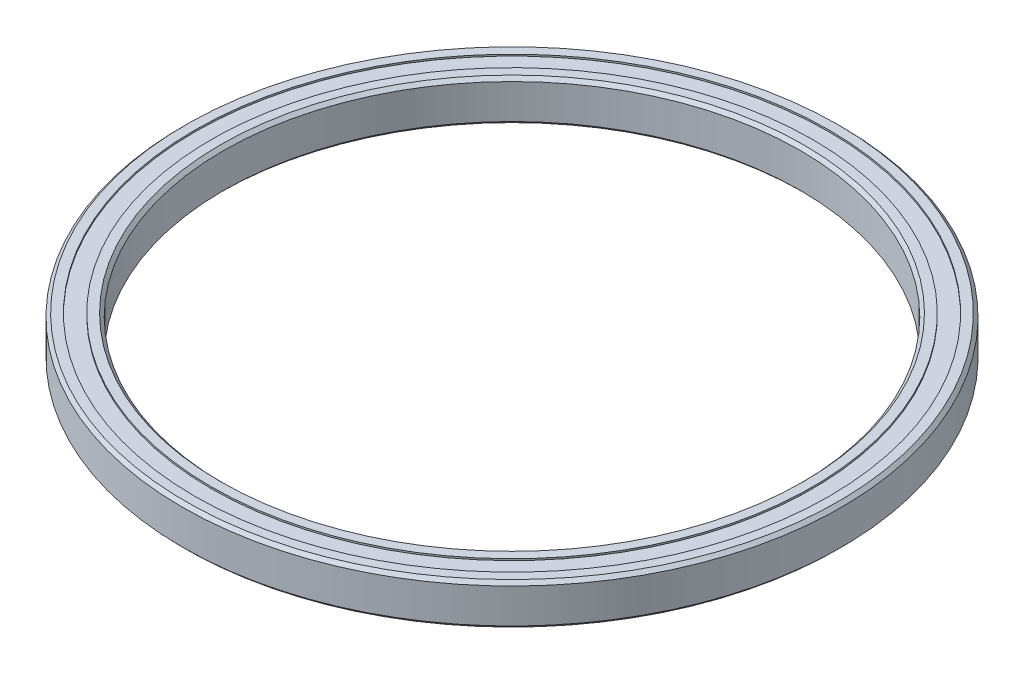
ISO-10303-21;
HEADER;
FILE_DESCRIPTION(('STEP AP214'),'2;1');
FILE_NAME('part.step','',(''),(''),'','','');
FILE_SCHEMA(('AUTOMOTIVE_DESIGN { 1 0 10303 214 1 1 1 1 }'));
ENDSEC;
DATA;
#1=APPLICATION_CONTEXT('core data for automotive mechanical design processes');
#2=APPLICATION_PROTOCOL_DEFINITION('international standard','automotive_design',2000,#1);
#3=PRODUCT_CONTEXT('',#1,'mechanical');
#4=PRODUCT('Part','Part','',(#3));
#5=PRODUCT_RELATED_PRODUCT_CATEGORY('part','',(#4));
#6=PRODUCT_DEFINITION_FORMATION('','',#4);
#7=PRODUCT_DEFINITION_CONTEXT('part definition',#1,'design');
#8=PRODUCT_DEFINITION('design','',#6,#7);
#9=PRODUCT_DEFINITION_SHAPE('','',#8);
#10=(LENGTH_UNIT() NAMED_UNIT(*) SI_UNIT(.MILLI.,.METRE.));
#11=(NAMED_UNIT(*) PLANE_ANGLE_UNIT() SI_UNIT($,.RADIAN.));
#12=(NAMED_UNIT(*) SI_UNIT($,.STERADIAN.) SOLID_ANGLE_UNIT());
#13=UNCERTAINTY_MEASURE_WITH_UNIT(LENGTH_MEASURE(1.E-05),#10,'distance_accuracy_value','');
#14=(GEOMETRIC_REPRESENTATION_CONTEXT(3) GLOBAL_UNCERTAINTY_ASSIGNED_CONTEXT((#13)) GLOBAL_UNIT_ASSIGNED_CONTEXT((#10,
#11,#12)) REPRESENTATION_CONTEXT('',''));
#15=CARTESIAN_POINT('',(0.,0.,0.));
#16=DIRECTION('',(0.,0.,1.));
#17=DIRECTION('',(1.,0.,0.));
#18=AXIS2_PLACEMENT_3D('',#15,#16,#17);
#19=CARTESIAN_POINT('',(0.,3.175,0.));
#20=DIRECTION('',(0.,-1.,0.));
#21=DIRECTION('',(0.,0.,-1.));
#22=AXIS2_PLACEMENT_3D('',#19,#20,#21);
#23=CONICAL_SURFACE('',#22,50.292,0.785398163397459);
#24=CARTESIAN_POINT('',(0.,2.667,0.));
#25=DIRECTION('',(0.,-1.,0.));
#26=DIRECTION('',(0.,0.,-1.));
#27=AXIS2_PLACEMENT_3D('',#24,#25,#26);
#28=CIRCLE('',#27,50.8);
#29=CARTESIAN_POINT('',(0.,2.667,-50.8));
#30=VERTEX_POINT('',#29);
#31=EDGE_CURVE('E66',#30,#30,#28,.T.);
#32=ORIENTED_EDGE('',*,*,#31,.F.);
#33=EDGE_LOOP('',(#32));
#34=FACE_BOUND('',#33,.T.);
#35=CARTESIAN_POINT('',(0.,3.175,0.));
#36=DIRECTION('',(0.,-1.,0.));
#37=DIRECTION('',(0.,0.,-1.));
#38=AXIS2_PLACEMENT_3D('',#35,#36,#37);
#39=CIRCLE('',#38,50.292);
#40=CARTESIAN_POINT('',(0.,3.175,-50.292));
#41=VERTEX_POINT('',#40);
#42=EDGE_CURVE('E10',#41,#41,#39,.T.);
#43=ORIENTED_EDGE('',*,*,#42,.T.);
#44=EDGE_LOOP('',(#43));
#45=FACE_BOUND('',#44,.T.);
#46=ADVANCED_FACE('F14',(#34,#45),#23,.T.);
#47=CARTESIAN_POINT('',(-50.292,3.175,0.));
#48=DIRECTION('',(0.,-1.,0.));
#49=DIRECTION('',(0.,0.,-1.));
#50=AXIS2_PLACEMENT_3D('',#47,#48,#49);
#51=PLANE('',#50);
#52=ORIENTED_EDGE('',*,*,#42,.F.);
#53=EDGE_LOOP('',(#52));
#54=FACE_BOUND('',#53,.T.);
#55=CARTESIAN_POINT('',(0.,3.175,0.));
#56=DIRECTION('',(0.,-1.,0.));
#57=DIRECTION('',(0.,0.,-1.));
#58=AXIS2_PLACEMENT_3D('',#55,#56,#57);
#59=CIRCLE('',#58,48.895);
#60=CARTESIAN_POINT('',(0.,3.175,-48.895));
#61=VERTEX_POINT('',#60);
#62=EDGE_CURVE('E20',#61,#61,#59,.T.);
#63=ORIENTED_EDGE('',*,*,#62,.T.);
#64=EDGE_LOOP('',(#63));
#65=FACE_BOUND('',#64,.T.);
#66=ADVANCED_FACE('F73',(#54,#65),#51,.F.);
#67=CARTESIAN_POINT('',(0.,0.,0.));
#68=DIRECTION('',(0.,-1.,0.));
#69=DIRECTION('',(0.,0.,-1.));
#70=AXIS2_PLACEMENT_3D('',#67,#68,#69);
#71=CYLINDRICAL_SURFACE('',#70,48.895);
#72=ORIENTED_EDGE('',*,*,#62,.F.);
#73=EDGE_LOOP('',(#72));
#74=FACE_BOUND('',#73,.T.);
#75=CARTESIAN_POINT('',(0.,2.921,0.));
#76=DIRECTION('',(0.,-1.,0.));
#77=DIRECTION('',(0.,0.,-1.));
#78=AXIS2_PLACEMENT_3D('',#75,#76,#77);
#79=CIRCLE('',#78,48.895);
#80=CARTESIAN_POINT('',(0.,2.921,-48.895));
#81=VERTEX_POINT('',#80);
#82=EDGE_CURVE('E24',#81,#81,#79,.T.);
#83=ORIENTED_EDGE('',*,*,#82,.T.);
#84=EDGE_LOOP('',(#83));
#85=FACE_BOUND('',#84,.T.);
#86=ADVANCED_FACE('F79',(#74,#85),#71,.F.);
#87=CARTESIAN_POINT('',(-48.895,2.921,0.));
#88=DIRECTION('',(0.,-1.,0.));
#89=DIRECTION('',(0.,0.,-1.));
#90=AXIS2_PLACEMENT_3D('',#87,#88,#89);
#91=PLANE('',#90);
#92=ORIENTED_EDGE('',*,*,#82,.F.);
#93=EDGE_LOOP('',(#92));
#94=FACE_BOUND('',#93,.T.);
#95=CARTESIAN_POINT('',(0.,2.921,0.));
#96=DIRECTION('',(0.,-1.,0.));
#97=DIRECTION('',(0.,0.,-1.));
#98=AXIS2_PLACEMENT_3D('',#95,#96,#97);
#99=CIRCLE('',#98,46.355);
#100=CARTESIAN_POINT('',(0.,2.921,-46.355));
#101=VERTEX_POINT('',#100);
#102=EDGE_CURVE('E28',#101,#101,#99,.T.);
#103=ORIENTED_EDGE('',*,*,#102,.T.);
#104=EDGE_LOOP('',(#103));
#105=FACE_BOUND('',#104,.T.);
#106=ADVANCED_FACE('F85',(#94,#105),#91,.F.);
#107=CARTESIAN_POINT('',(0.,0.,0.));
#108=DIRECTION('',(0.,-1.,0.));
#109=DIRECTION('',(0.,0.,-1.));
#110=AXIS2_PLACEMENT_3D('',#107,#108,#109);
#111=CYLINDRICAL_SURFACE('',#110,46.355);
#112=ORIENTED_EDGE('',*,*,#102,.F.);
#113=EDGE_LOOP('',(#112));
#114=FACE_BOUND('',#113,.T.);
#115=CARTESIAN_POINT('',(0.,3.175,0.));
#116=DIRECTION('',(0.,-1.,0.));
#117=DIRECTION('',(0.,0.,-1.));
#118=AXIS2_PLACEMENT_3D('',#115,#116,#117);
#119=CIRCLE('',#118,46.355);
#120=CARTESIAN_POINT('',(0.,3.175,-46.355));
#121=VERTEX_POINT('',#120);
#122=EDGE_CURVE('E33',#121,#121,#119,.T.);
#123=ORIENTED_EDGE('',*,*,#122,.T.);
#124=EDGE_LOOP('',(#123));
#125=FACE_BOUND('',#124,.T.);
#126=ADVANCED_FACE('F91',(#114,#125),#111,.T.);
#127=CARTESIAN_POINT('',(-46.355,3.175,0.));
#128=DIRECTION('',(0.,-1.,0.));
#129=DIRECTION('',(0.,0.,-1.));
#130=AXIS2_PLACEMENT_3D('',#127,#128,#129);
#131=PLANE('',#130);
#132=ORIENTED_EDGE('',*,*,#122,.F.);
#133=EDGE_LOOP('',(#132));
#134=FACE_BOUND('',#133,.T.);
#135=CARTESIAN_POINT('',(0.,3.175,0.));
#136=DIRECTION('',(0.,-1.,0.));
#137=DIRECTION('',(0.,0.,-1.));
#138=AXIS2_PLACEMENT_3D('',#135,#136,#137);
#139=CIRCLE('',#138,44.958);
#140=CARTESIAN_POINT('',(0.,3.175,-44.958));
#141=VERTEX_POINT('',#140);
#142=EDGE_CURVE('E36',#141,#141,#139,.T.);
#143=ORIENTED_EDGE('',*,*,#142,.T.);
#144=EDGE_LOOP('',(#143));
#145=FACE_BOUND('',#144,.T.);
#146=ADVANCED_FACE('F95',(#134,#145),#131,.F.);
#147=CARTESIAN_POINT('',(0.,2.667,0.));
#148=DIRECTION('',(0.,1.,0.));
#149=DIRECTION('',(0.,0.,1.));
#150=AXIS2_PLACEMENT_3D('',#147,#148,#149);
#151=CONICAL_SURFACE('',#150,44.45,0.785398163397448);
#152=ORIENTED_EDGE('',*,*,#142,.F.);
#153=EDGE_LOOP('',(#152));
#154=FACE_BOUND('',#153,.T.);
#155=CARTESIAN_POINT('',(0.,2.667,0.));
#156=DIRECTION('',(0.,-1.,0.));
#157=DIRECTION('',(0.,0.,-1.));
#158=AXIS2_PLACEMENT_3D('',#155,#156,#157);
#159=CIRCLE('',#158,44.45);
#160=CARTESIAN_POINT('',(0.,2.667,-44.45));
#161=VERTEX_POINT('',#160);
#162=EDGE_CURVE('E39',#161,#161,#159,.T.);
#163=ORIENTED_EDGE('',*,*,#162,.T.);
#164=EDGE_LOOP('',(#163));
#165=FACE_BOUND('',#164,.T.);
#166=ADVANCED_FACE('F99',(#154,#165),#151,.F.);
#167=CARTESIAN_POINT('',(0.,0.,0.));
#168=DIRECTION('',(0.,-1.,0.));
#169=DIRECTION('',(0.,0.,-1.));
#170=AXIS2_PLACEMENT_3D('',#167,#168,#169);
#171=CYLINDRICAL_SURFACE('',#170,44.45);
#172=ORIENTED_EDGE('',*,*,#162,.F.);
#173=EDGE_LOOP('',(#172));
#174=FACE_BOUND('',#173,.T.);
#175=CARTESIAN_POINT('',(0.,-2.667,0.));
#176=DIRECTION('',(0.,-1.,0.));
#177=DIRECTION('',(0.,0.,-1.));
#178=AXIS2_PLACEMENT_3D('',#175,#176,#177);
#179=CIRCLE('',#178,44.45);
#180=CARTESIAN_POINT('',(0.,-2.667,-44.45));
#181=VERTEX_POINT('',#180);
#182=EDGE_CURVE('E42',#181,#181,#179,.T.);
#183=ORIENTED_EDGE('',*,*,#182,.T.);
#184=EDGE_LOOP('',(#183));
#185=FACE_BOUND('',#184,.T.);
#186=ADVANCED_FACE('F103',(#174,#185),#171,.F.);
#187=CARTESIAN_POINT('',(0.,-3.175,0.));
#188=DIRECTION('',(0.,-1.,0.));
#189=DIRECTION('',(0.,0.,-1.));
#190=AXIS2_PLACEMENT_3D('',#187,#188,#189);
#191=CONICAL_SURFACE('',#190,44.958,0.785398163397445);
#192=ORIENTED_EDGE('',*,*,#182,.F.);
#193=EDGE_LOOP('',(#192));
#194=FACE_BOUND('',#193,.T.);
#195=CARTESIAN_POINT('',(0.,-3.175,0.));
#196=DIRECTION('',(0.,-1.,0.));
#197=DIRECTION('',(0.,0.,-1.));
#198=AXIS2_PLACEMENT_3D('',#195,#196,#197);
#199=CIRCLE('',#198,44.958);
#200=CARTESIAN_POINT('',(0.,-3.175,-44.958));
#201=VERTEX_POINT('',#200);
#202=EDGE_CURVE('E45',#201,#201,#199,.T.);
#203=ORIENTED_EDGE('',*,*,#202,.T.);
#204=EDGE_LOOP('',(#203));
#205=FACE_BOUND('',#204,.T.);
#206=ADVANCED_FACE('F107',(#194,#205),#191,.F.);
#207=CARTESIAN_POINT('',(-44.958,-3.175,0.));
#208=DIRECTION('',(0.,1.,0.));
#209=DIRECTION('',(0.,0.,1.));
#210=AXIS2_PLACEMENT_3D('',#207,#208,#209);
#211=PLANE('',#210);
#212=ORIENTED_EDGE('',*,*,#202,.F.);
#213=EDGE_LOOP('',(#212));
#214=FACE_BOUND('',#213,.T.);
#215=CARTESIAN_POINT('',(0.,-3.175,0.));
#216=DIRECTION('',(0.,-1.,0.));
#217=DIRECTION('',(0.,0.,-1.));
#218=AXIS2_PLACEMENT_3D('',#215,#216,#217);
#219=CIRCLE('',#218,46.355);
#220=CARTESIAN_POINT('',(0.,-3.175,-46.355));
#221=VERTEX_POINT('',#220);
#222=EDGE_CURVE('E48',#221,#221,#219,.T.);
#223=ORIENTED_EDGE('',*,*,#222,.T.);
#224=EDGE_LOOP('',(#223));
#225=FACE_BOUND('',#224,.T.);
#226=ADVANCED_FACE('F111',(#214,#225),#211,.F.);
#227=CARTESIAN_POINT('',(0.,0.,0.));
#228=DIRECTION('',(0.,-1.,0.));
#229=DIRECTION('',(0.,0.,-1.));
#230=AXIS2_PLACEMENT_3D('',#227,#228,#229);
#231=CYLINDRICAL_SURFACE('',#230,46.355);
#232=ORIENTED_EDGE('',*,*,#222,.F.);
#233=EDGE_LOOP('',(#232));
#234=FACE_BOUND('',#233,.T.);
#235=CARTESIAN_POINT('',(0.,-2.921,0.));
#236=DIRECTION('',(0.,-1.,0.));
#237=DIRECTION('',(0.,0.,-1.));
#238=AXIS2_PLACEMENT_3D('',#235,#236,#237);
#239=CIRCLE('',#238,46.355);
#240=CARTESIAN_POINT('',(0.,-2.921,-46.355));
#241=VERTEX_POINT('',#240);
#242=EDGE_CURVE('E51',#241,#241,#239,.T.);
#243=ORIENTED_EDGE('',*,*,#242,.T.);
#244=EDGE_LOOP('',(#243));
#245=FACE_BOUND('',#244,.T.);
#246=ADVANCED_FACE('F115',(#234,#245),#231,.T.);
#247=CARTESIAN_POINT('',(-46.355,-2.921,0.));
#248=DIRECTION('',(0.,1.,0.));
#249=DIRECTION('',(0.,0.,1.));
#250=AXIS2_PLACEMENT_3D('',#247,#248,#249);
#251=PLANE('',#250);
#252=ORIENTED_EDGE('',*,*,#242,.F.);
#253=EDGE_LOOP('',(#252));
#254=FACE_BOUND('',#253,.T.);
#255=CARTESIAN_POINT('',(0.,-2.921,0.));
#256=DIRECTION('',(0.,-1.,0.));
#257=DIRECTION('',(0.,0.,-1.));
#258=AXIS2_PLACEMENT_3D('',#255,#256,#257);
#259=CIRCLE('',#258,48.895);
#260=CARTESIAN_POINT('',(0.,-2.921,-48.895));
#261=VERTEX_POINT('',#260);
#262=EDGE_CURVE('E54',#261,#261,#259,.T.);
#263=ORIENTED_EDGE('',*,*,#262,.T.);
#264=EDGE_LOOP('',(#263));
#265=FACE_BOUND('',#264,.T.);
#266=ADVANCED_FACE('F119',(#254,#265),#251,.F.);
#267=CARTESIAN_POINT('',(0.,0.,0.));
#268=DIRECTION('',(0.,-1.,0.));
#269=DIRECTION('',(0.,0.,-1.));
#270=AXIS2_PLACEMENT_3D('',#267,#268,#269);
#271=CYLINDRICAL_SURFACE('',#270,48.895);
#272=ORIENTED_EDGE('',*,*,#262,.F.);
#273=EDGE_LOOP('',(#272));
#274=FACE_BOUND('',#273,.T.);
#275=CARTESIAN_POINT('',(0.,-3.175,0.));
#276=DIRECTION('',(0.,-1.,0.));
#277=DIRECTION('',(0.,0.,-1.));
#278=AXIS2_PLACEMENT_3D('',#275,#276,#277);
#279=CIRCLE('',#278,48.895);
#280=CARTESIAN_POINT('',(0.,-3.175,-48.895));
#281=VERTEX_POINT('',#280);
#282=EDGE_CURVE('E57',#281,#281,#279,.T.);
#283=ORIENTED_EDGE('',*,*,#282,.T.);
#284=EDGE_LOOP('',(#283));
#285=FACE_BOUND('',#284,.T.);
#286=ADVANCED_FACE('F123',(#274,#285),#271,.F.);
#287=CARTESIAN_POINT('',(-48.895,-3.175,0.));
#288=DIRECTION('',(0.,1.,0.));
#289=DIRECTION('',(0.,0.,1.));
#290=AXIS2_PLACEMENT_3D('',#287,#288,#289);
#291=PLANE('',#290);
#292=ORIENTED_EDGE('',*,*,#282,.F.);
#293=EDGE_LOOP('',(#292));
#294=FACE_BOUND('',#293,.T.);
#295=CARTESIAN_POINT('',(0.,-3.175,0.));
#296=DIRECTION('',(0.,-1.,0.));
#297=DIRECTION('',(0.,0.,-1.));
#298=AXIS2_PLACEMENT_3D('',#295,#296,#297);
#299=CIRCLE('',#298,50.292);
#300=CARTESIAN_POINT('',(0.,-3.175,-50.292));
#301=VERTEX_POINT('',#300);
#302=EDGE_CURVE('E60',#301,#301,#299,.T.);
#303=ORIENTED_EDGE('',*,*,#302,.T.);
#304=EDGE_LOOP('',(#303));
#305=FACE_BOUND('',#304,.T.);
#306=ADVANCED_FACE('F127',(#294,#305),#291,.F.);
#307=CARTESIAN_POINT('',(0.,-2.667,0.));
#308=DIRECTION('',(0.,1.,0.));
#309=DIRECTION('',(0.,0.,1.));
#310=AXIS2_PLACEMENT_3D('',#307,#308,#309);
#311=CONICAL_SURFACE('',#310,50.8,0.785398163397446);
#312=ORIENTED_EDGE('',*,*,#302,.F.);
#313=EDGE_LOOP('',(#312));
#314=FACE_BOUND('',#313,.T.);
#315=CARTESIAN_POINT('',(0.,-2.667,0.));
#316=DIRECTION('',(0.,-1.,0.));
#317=DIRECTION('',(0.,0.,-1.));
#318=AXIS2_PLACEMENT_3D('',#315,#316,#317);
#319=CIRCLE('',#318,50.8);
#320=CARTESIAN_POINT('',(0.,-2.667,-50.8));
#321=VERTEX_POINT('',#320);
#322=EDGE_CURVE('E63',#321,#321,#319,.T.);
#323=ORIENTED_EDGE('',*,*,#322,.T.);
#324=EDGE_LOOP('',(#323));
#325=FACE_BOUND('',#324,.T.);
#326=ADVANCED_FACE('F131',(#314,#325),#311,.T.);
#327=CARTESIAN_POINT('',(0.,0.,0.));
#328=DIRECTION('',(0.,-1.,0.));
#329=DIRECTION('',(0.,0.,-1.));
#330=AXIS2_PLACEMENT_3D('',#327,#328,#329);
#331=CYLINDRICAL_SURFACE('',#330,50.8);
#332=ORIENTED_EDGE('',*,*,#322,.F.);
#333=EDGE_LOOP('',(#332));
#334=FACE_BOUND('',#333,.T.);
#335=ORIENTED_EDGE('',*,*,#31,.T.);
#336=EDGE_LOOP('',(#335));
#337=FACE_BOUND('',#336,.T.);
#338=ADVANCED_FACE('F70',(#334,#337),#331,.T.);
#339=CLOSED_SHELL('',(#46,#66,#86,#106,#126,#146,#166,#186,#206,#226,#246,#266,#286,#306,#326,#338));
#340=MANIFOLD_SOLID_BREP('B1',#339);
#341=ADVANCED_BREP_SHAPE_REPRESENTATION('',(#18,#340),#14);
#342=SHAPE_DEFINITION_REPRESENTATION(#9,#341);
ENDSEC;
END-ISO-10303-21;
